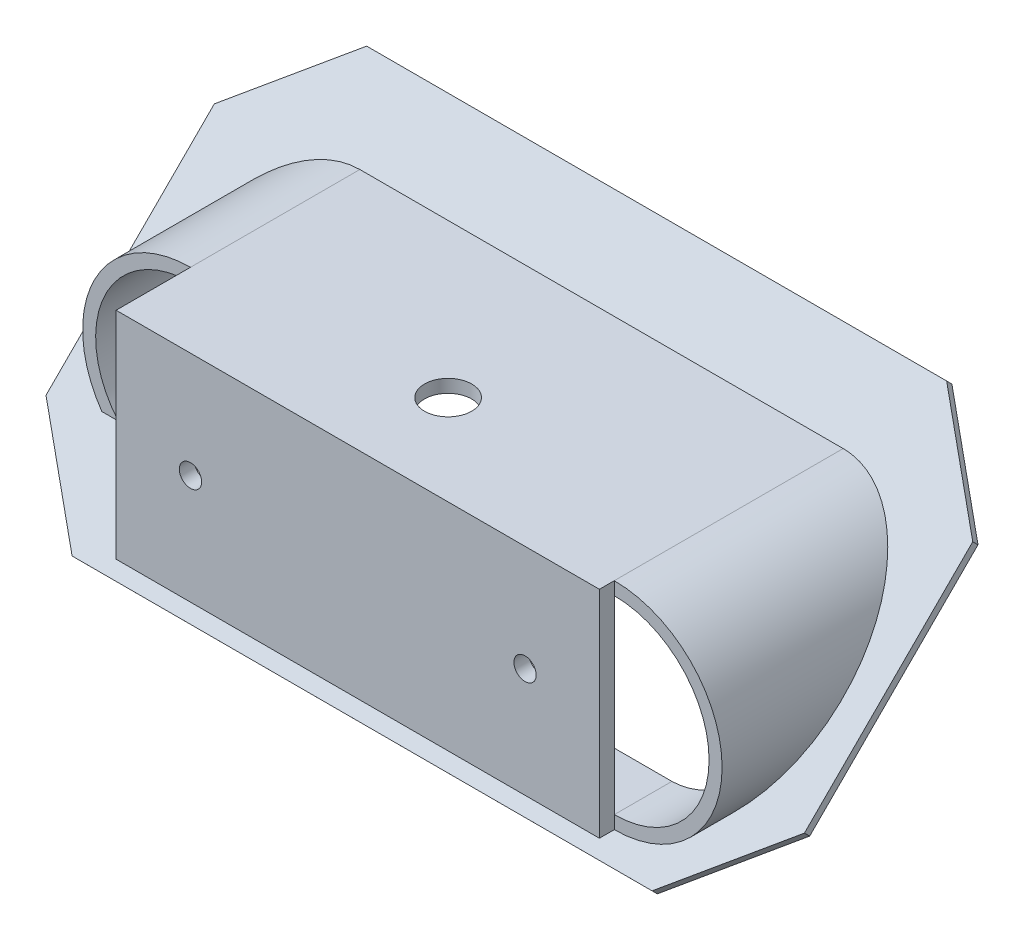
ISO-10303-21;
HEADER;
FILE_DESCRIPTION(('STEP AP214'),'2;1');
FILE_NAME('part.step','',(''),(''),'','','');
FILE_SCHEMA(('AUTOMOTIVE_DESIGN { 1 0 10303 214 1 1 1 1 }'));
ENDSEC;
DATA;
#1=APPLICATION_CONTEXT('core data for automotive mechanical design processes');
#2=APPLICATION_PROTOCOL_DEFINITION('international standard','automotive_design',2000,#1);
#3=PRODUCT_CONTEXT('',#1,'mechanical');
#4=PRODUCT('Part','Part','',(#3));
#5=PRODUCT_RELATED_PRODUCT_CATEGORY('part','',(#4));
#6=PRODUCT_DEFINITION_FORMATION('','',#4);
#7=PRODUCT_DEFINITION_CONTEXT('part definition',#1,'design');
#8=PRODUCT_DEFINITION('design','',#6,#7);
#9=PRODUCT_DEFINITION_SHAPE('','',#8);
#10=(LENGTH_UNIT() NAMED_UNIT(*) SI_UNIT(.MILLI.,.METRE.));
#11=(NAMED_UNIT(*) PLANE_ANGLE_UNIT() SI_UNIT($,.RADIAN.));
#12=(NAMED_UNIT(*) SI_UNIT($,.STERADIAN.) SOLID_ANGLE_UNIT());
#13=UNCERTAINTY_MEASURE_WITH_UNIT(LENGTH_MEASURE(1.E-05),#10,'distance_accuracy_value','');
#14=(GEOMETRIC_REPRESENTATION_CONTEXT(3) GLOBAL_UNCERTAINTY_ASSIGNED_CONTEXT((#13)) GLOBAL_UNIT_ASSIGNED_CONTEXT((#10,
#11,#12)) REPRESENTATION_CONTEXT('',''));
#15=CARTESIAN_POINT('',(0.,0.,0.));
#16=DIRECTION('',(0.,0.,1.));
#17=DIRECTION('',(1.,0.,0.));
#18=AXIS2_PLACEMENT_3D('',#15,#16,#17);
#19=CARTESIAN_POINT('',(69.7281455494334,21.9121249549721,35.0250079347562));
#20=DIRECTION('',(0.,0.,1.));
#21=DIRECTION('',(1.,0.,0.));
#22=AXIS2_PLACEMENT_3D('',#19,#20,#21);
#23=PLANE('',#22);
#24=DIRECTION('',(0.,1.,0.));
#25=VECTOR('',#24,1.);
#26=CARTESIAN_POINT('',(32.5000000000001,-14.5,35.0250079347562));
#27=LINE('',#26,#25);
#28=CARTESIAN_POINT('',(32.5000000000001,-14.5,35.0250079347562));
#29=VERTEX_POINT('',#28);
#30=CARTESIAN_POINT('',(32.5000000000001,-12.75,35.0250079347562));
#31=VERTEX_POINT('',#30);
#32=EDGE_CURVE('E51',#29,#31,#27,.T.);
#33=ORIENTED_EDGE('',*,*,#32,.F.);
#34=CARTESIAN_POINT('',(32.5000000000001,0.,35.0250079347562));
#35=DIRECTION('',(0.,0.,1.));
#36=DIRECTION('',(1.,0.,0.));
#37=AXIS2_PLACEMENT_3D('',#34,#35,#36);
#38=CIRCLE('',#37,14.5);
#39=CARTESIAN_POINT('',(32.5000000000001,14.5,35.0250079347562));
#40=VERTEX_POINT('',#39);
#41=EDGE_CURVE('E280',#29,#40,#38,.T.);
#42=ORIENTED_EDGE('',*,*,#41,.T.);
#43=CARTESIAN_POINT('',(32.5000000000001,12.75,35.0250079347562));
#44=VERTEX_POINT('',#43);
#45=EDGE_CURVE('E11',#44,#40,#27,.T.);
#46=ORIENTED_EDGE('',*,*,#45,.F.);
#47=CARTESIAN_POINT('',(32.5000000000001,0.,35.0250079347562));
#48=DIRECTION('',(0.,0.,1.));
#49=DIRECTION('',(1.,0.,0.));
#50=AXIS2_PLACEMENT_3D('',#47,#48,#49);
#51=CIRCLE('',#50,12.75);
#52=EDGE_CURVE('E274',#44,#31,#51,.F.);
#53=ORIENTED_EDGE('',*,*,#52,.T.);
#54=EDGE_LOOP('',(#33,#42,#46,#53));
#55=FACE_BOUND('',#54,.T.);
#56=ADVANCED_FACE('F40',(#55),#23,.T.);
#57=CARTESIAN_POINT('',(0.,14.5,80.0000000000001));
#58=DIRECTION('',(0.,-1.,0.));
#59=DIRECTION('',(0.,0.,-1.));
#60=AXIS2_PLACEMENT_3D('',#57,#58,#59);
#61=PLANE('',#60);
#62=CARTESIAN_POINT('',(2.62925291935353E-05,14.5,24.8750079347541));
#63=DIRECTION('',(0.,1.,0.));
#64=DIRECTION('',(0.,0.,1.));
#65=AXIS2_PLACEMENT_3D('',#62,#63,#64);
#66=CIRCLE('',#65,3.17499999999999);
#67=CARTESIAN_POINT('',(2.62925291935353E-05,14.5,28.0500079347541));
#68=VERTEX_POINT('',#67);
#69=EDGE_CURVE('E247',#68,#68,#66,.T.);
#70=ORIENTED_EDGE('',*,*,#69,.F.);
#71=EDGE_LOOP('',(#70));
#72=FACE_BOUND('',#71,.T.);
#73=DIRECTION('',(0.,0.,-1.));
#74=VECTOR('',#73,1.);
#75=CARTESIAN_POINT('',(-32.5000000000001,14.5,80.0000000000001));
#76=LINE('',#75,#74);
#77=CARTESIAN_POINT('',(-32.5000000000001,14.5,37.0250079347562));
#78=VERTEX_POINT('',#77);
#79=CARTESIAN_POINT('',(-32.5000000000001,14.5,27.0250079347562));
#80=VERTEX_POINT('',#79);
#81=EDGE_CURVE('E317',#78,#80,#76,.T.);
#82=ORIENTED_EDGE('',*,*,#81,.F.);
#83=DIRECTION('',(1.,0.,0.));
#84=VECTOR('',#83,1.);
#85=CARTESIAN_POINT('',(-32.5000000000001,14.5,37.0250079347562));
#86=LINE('',#85,#84);
#87=CARTESIAN_POINT('',(32.5000000000001,14.5,37.0250079347562));
#88=VERTEX_POINT('',#87);
#89=EDGE_CURVE('E224',#78,#88,#86,.T.);
#90=ORIENTED_EDGE('',*,*,#89,.T.);
#91=DIRECTION('',(0.,0.,-1.));
#92=VECTOR('',#91,1.);
#93=CARTESIAN_POINT('',(32.5000000000001,14.5,35.0250079347562));
#94=LINE('',#93,#92);
#95=EDGE_CURVE('E232',#88,#40,#94,.T.);
#96=ORIENTED_EDGE('',*,*,#95,.T.);
#97=DIRECTION('',(0.,0.,-1.));
#98=VECTOR('',#97,1.);
#99=CARTESIAN_POINT('',(32.5000000000001,14.5,80.0000000000001));
#100=LINE('',#99,#98);
#101=CARTESIAN_POINT('',(32.5000000000001,14.5,4.24460595078653));
#102=VERTEX_POINT('',#101);
#103=EDGE_CURVE('E314',#40,#102,#100,.T.);
#104=ORIENTED_EDGE('',*,*,#103,.T.);
#105=DIRECTION('',(-1.,0.,0.));
#106=VECTOR('',#105,1.);
#107=CARTESIAN_POINT('',(0.,14.5,4.24460595078653));
#108=LINE('',#107,#106);
#109=CARTESIAN_POINT('',(-32.5000000000001,14.5,4.24460595078652));
#110=VERTEX_POINT('',#109);
#111=EDGE_CURVE('E311',#102,#110,#108,.T.);
#112=ORIENTED_EDGE('',*,*,#111,.T.);
#113=EDGE_CURVE('E215',#80,#110,#76,.T.);
#114=ORIENTED_EDGE('',*,*,#113,.F.);
#115=EDGE_LOOP('',(#82,#90,#96,#104,#112,#114));
#116=FACE_BOUND('',#115,.T.);
#117=ADVANCED_FACE('F472',(#72,#116),#61,.F.);
#118=CARTESIAN_POINT('',(-32.5000000000001,0.,80.0000000000001));
#119=DIRECTION('',(0.,0.,-1.));
#120=DIRECTION('',(-1.,0.,0.));
#121=AXIS2_PLACEMENT_3D('',#118,#119,#120);
#122=CYLINDRICAL_SURFACE('',#121,14.5);
#123=CARTESIAN_POINT('',(-32.5000000000001,0.,18.7580361379704));
#124=DIRECTION('',(0.,0.707434021964028,0.706779388895714));
#125=DIRECTION('',(0.,0.706779388895714,-0.707434021964028));
#126=AXIS2_PLACEMENT_3D('',#123,#124,#125);
#127=ELLIPSE('',#126,20.5155954288015,14.5);
#128=CARTESIAN_POINT('',(-44.4177851377498,-8.25932184930662,27.0250079347562));
#129=VERTEX_POINT('',#128);
#130=EDGE_CURVE('E308',#110,#129,#127,.T.);
#131=ORIENTED_EDGE('',*,*,#130,.T.);
#132=CARTESIAN_POINT('',(-32.5000000000001,0.,27.0250079347562));
#133=DIRECTION('',(0.,0.,-1.));
#134=DIRECTION('',(-1.,0.,0.));
#135=AXIS2_PLACEMENT_3D('',#132,#133,#134);
#136=CIRCLE('',#135,14.5);
#137=EDGE_CURVE('E268',#129,#80,#136,.T.);
#138=ORIENTED_EDGE('',*,*,#137,.T.);
#139=ORIENTED_EDGE('',*,*,#113,.T.);
#140=EDGE_LOOP('',(#131,#138,#139));
#141=FACE_BOUND('',#140,.T.);
#142=ADVANCED_FACE('F478',(#141),#122,.T.);
#143=CARTESIAN_POINT('',(0.,-14.5,80.0000000000001));
#144=DIRECTION('',(0.,-1.,0.));
#145=DIRECTION('',(0.,0.,-1.));
#146=AXIS2_PLACEMENT_3D('',#143,#144,#145);
#147=PLANE('',#146);
#148=DIRECTION('',(0.,0.,-1.));
#149=VECTOR('',#148,1.);
#150=CARTESIAN_POINT('',(32.5000000000001,-14.5,80.0000000000001));
#151=LINE('',#150,#149);
#152=CARTESIAN_POINT('',(32.5000000000001,-14.5,33.2714663251543));
#153=VERTEX_POINT('',#152);
#154=EDGE_CURVE('E216',#29,#153,#151,.T.);
#155=ORIENTED_EDGE('',*,*,#154,.F.);
#156=DIRECTION('',(0.,0.,-1.));
#157=VECTOR('',#156,1.);
#158=CARTESIAN_POINT('',(32.5000000000001,-14.5,35.0250079347562));
#159=LINE('',#158,#157);
#160=CARTESIAN_POINT('',(32.5000000000001,-14.5,37.0250079347562));
#161=VERTEX_POINT('',#160);
#162=EDGE_CURVE('E231',#161,#29,#159,.T.);
#163=ORIENTED_EDGE('',*,*,#162,.F.);
#164=DIRECTION('',(1.,0.,0.));
#165=VECTOR('',#164,1.);
#166=CARTESIAN_POINT('',(-32.5000000000001,-14.5,37.0250079347562));
#167=LINE('',#166,#165);
#168=CARTESIAN_POINT('',(-32.5000000000001,-14.5,37.0250079347562));
#169=VERTEX_POINT('',#168);
#170=EDGE_CURVE('E221',#169,#161,#167,.T.);
#171=ORIENTED_EDGE('',*,*,#170,.F.);
#172=DIRECTION('',(0.,0.,-1.));
#173=VECTOR('',#172,1.);
#174=CARTESIAN_POINT('',(-32.5000000000001,-14.5,80.0000000000001));
#175=LINE('',#174,#173);
#176=CARTESIAN_POINT('',(-32.5000000000001,-14.5,33.2714663251542));
#177=VERTEX_POINT('',#176);
#178=EDGE_CURVE('E203',#169,#177,#175,.T.);
#179=ORIENTED_EDGE('',*,*,#178,.T.);
#180=DIRECTION('',(-1.,0.,0.));
#181=VECTOR('',#180,1.);
#182=CARTESIAN_POINT('',(0.,-14.5,33.2714663251543));
#183=LINE('',#182,#181);
#184=EDGE_CURVE('E306',#153,#177,#183,.T.);
#185=ORIENTED_EDGE('',*,*,#184,.F.);
#186=EDGE_LOOP('',(#155,#163,#171,#179,#185));
#187=FACE_BOUND('',#186,.T.);
#188=ADVANCED_FACE('F229',(#187),#147,.T.);
#189=CARTESIAN_POINT('',(32.5000000000001,0.,80.0000000000001));
#190=DIRECTION('',(0.,0.,-1.));
#191=DIRECTION('',(-1.,0.,0.));
#192=AXIS2_PLACEMENT_3D('',#189,#190,#191);
#193=CYLINDRICAL_SURFACE('',#192,14.5);
#194=ORIENTED_EDGE('',*,*,#41,.F.);
#195=ORIENTED_EDGE('',*,*,#154,.T.);
#196=CARTESIAN_POINT('',(32.5000000000001,0.,18.7580361379704));
#197=DIRECTION('',(0.,0.707434021964028,0.706779388895714));
#198=DIRECTION('',(0.,0.706779388895714,-0.707434021964028));
#199=AXIS2_PLACEMENT_3D('',#196,#197,#198);
#200=ELLIPSE('',#199,20.5155954288015,14.5);
#201=EDGE_CURVE('E319',#153,#102,#200,.T.);
#202=ORIENTED_EDGE('',*,*,#201,.T.);
#203=ORIENTED_EDGE('',*,*,#103,.F.);
#204=EDGE_LOOP('',(#194,#195,#202,#203));
#205=FACE_BOUND('',#204,.T.);
#206=ADVANCED_FACE('F500',(#205),#193,.T.);
#207=CARTESIAN_POINT('',(-32.5000000000001,0.,-5.29472242780894));
#208=DIRECTION('',(0.,0.,1.));
#209=DIRECTION('',(1.,0.,0.));
#210=AXIS2_PLACEMENT_3D('',#207,#208,#209);
#211=CYLINDRICAL_SURFACE('',#210,12.75);
#212=CARTESIAN_POINT('',(-32.5000000000001,0.,27.0250079347562));
#213=DIRECTION('',(0.,0.,-1.));
#214=DIRECTION('',(-1.,0.,0.));
#215=AXIS2_PLACEMENT_3D('',#212,#213,#214);
#216=CIRCLE('',#215,12.75);
#217=CARTESIAN_POINT('',(-32.5000000000001,12.75,27.0250079347562));
#218=VERTEX_POINT('',#217);
#219=CARTESIAN_POINT('',(-42.2131921935875,-8.25932184930662,27.0250079347562));
#220=VERTEX_POINT('',#219);
#221=EDGE_CURVE('E265',#218,#220,#216,.F.);
#222=ORIENTED_EDGE('',*,*,#221,.T.);
#223=CARTESIAN_POINT('',(-32.5000000000001,0.,18.7580361379704));
#224=DIRECTION('',(0.,-0.707434021964029,-0.706779388895714));
#225=DIRECTION('',(0.,-0.706779388895714,0.707434021964029));
#226=AXIS2_PLACEMENT_3D('',#223,#224,#225);
#227=ELLIPSE('',#226,18.0395752908427,12.75);
#228=CARTESIAN_POINT('',(-32.5000000000001,-12.75,31.5198454404941));
#229=VERTEX_POINT('',#228);
#230=EDGE_CURVE('E271',#220,#229,#227,.F.);
#231=ORIENTED_EDGE('',*,*,#230,.T.);
#232=DIRECTION('',(0.,0.,1.));
#233=VECTOR('',#232,1.);
#234=CARTESIAN_POINT('',(-32.5000000000001,-12.75,-5.29472242780894));
#235=LINE('',#234,#233);
#236=CARTESIAN_POINT('',(-32.5000000000001,-12.75,27.2752394897076));
#237=VERTEX_POINT('',#236);
#238=EDGE_CURVE('E283',#237,#229,#235,.T.);
#239=ORIENTED_EDGE('',*,*,#238,.F.);
#240=CARTESIAN_POINT('',(-32.5000000000001,0.,14.5134301871838));
#241=DIRECTION('',(0.,0.707434021964029,0.706779388895714));
#242=DIRECTION('',(0.,-0.706779388895714,0.707434021964029));
#243=AXIS2_PLACEMENT_3D('',#240,#241,#242);
#244=ELLIPSE('',#243,18.0395752908427,12.75);
#245=CARTESIAN_POINT('',(-32.5000000000001,12.75,1.75162088466012));
#246=VERTEX_POINT('',#245);
#247=EDGE_CURVE('E330',#246,#237,#244,.T.);
#248=ORIENTED_EDGE('',*,*,#247,.F.);
#249=DIRECTION('',(0.,0.,1.));
#250=VECTOR('',#249,1.);
#251=CARTESIAN_POINT('',(-32.5000000000001,12.75,-5.29472242780894));
#252=LINE('',#251,#250);
#253=EDGE_CURVE('E284',#246,#218,#252,.T.);
#254=ORIENTED_EDGE('',*,*,#253,.T.);
#255=EDGE_LOOP('',(#222,#231,#239,#248,#254));
#256=FACE_BOUND('',#255,.T.);
#257=ADVANCED_FACE('F489',(#256),#211,.F.);
#258=CARTESIAN_POINT('',(-32.5000000000001,12.75,-5.29472242780894));
#259=DIRECTION('',(0.,-1.,0.));
#260=DIRECTION('',(1.,0.,0.));
#261=AXIS2_PLACEMENT_3D('',#258,#259,#260);
#262=PLANE('',#261);
#263=CARTESIAN_POINT('',(2.62925291935353E-05,12.75,24.8750079347541));
#264=DIRECTION('',(0.,-1.,0.));
#265=DIRECTION('',(1.,0.,0.));
#266=AXIS2_PLACEMENT_3D('',#263,#264,#265);
#267=CIRCLE('',#266,3.17499999999999);
#268=CARTESIAN_POINT('',(3.17502629252919,12.75,24.8750079347541));
#269=VERTEX_POINT('',#268);
#270=EDGE_CURVE('E250',#269,#269,#267,.T.);
#271=ORIENTED_EDGE('',*,*,#270,.F.);
#272=EDGE_LOOP('',(#271));
#273=FACE_BOUND('',#272,.T.);
#274=DIRECTION('',(0.,0.,1.));
#275=VECTOR('',#274,1.);
#276=CARTESIAN_POINT('',(32.5000000000001,12.75,-5.29472242780894));
#277=LINE('',#276,#275);
#278=CARTESIAN_POINT('',(32.5000000000001,12.75,1.75162088466014));
#279=VERTEX_POINT('',#278);
#280=EDGE_CURVE('E288',#279,#44,#277,.T.);
#281=ORIENTED_EDGE('',*,*,#280,.T.);
#282=DIRECTION('',(-1.,0.,0.));
#283=VECTOR('',#282,1.);
#284=CARTESIAN_POINT('',(-32.5000000000001,12.75,35.0250079347562));
#285=LINE('',#284,#283);
#286=CARTESIAN_POINT('',(-32.5000000000001,12.75,35.0250079347562));
#287=VERTEX_POINT('',#286);
#288=EDGE_CURVE('E277',#44,#287,#285,.T.);
#289=ORIENTED_EDGE('',*,*,#288,.T.);
#290=DIRECTION('',(0.,0.,-1.));
#291=VECTOR('',#290,1.);
#292=CARTESIAN_POINT('',(-32.5000000000001,12.75,-5.29472242780894));
#293=LINE('',#292,#291);
#294=EDGE_CURVE('E262',#287,#218,#293,.T.);
#295=ORIENTED_EDGE('',*,*,#294,.T.);
#296=ORIENTED_EDGE('',*,*,#253,.F.);
#297=DIRECTION('',(1.,0.,0.));
#298=VECTOR('',#297,1.);
#299=CARTESIAN_POINT('',(-47.0000000000001,12.75,1.75162088466011));
#300=LINE('',#299,#298);
#301=EDGE_CURVE('E328',#246,#279,#300,.T.);
#302=ORIENTED_EDGE('',*,*,#301,.T.);
#303=EDGE_LOOP('',(#281,#289,#295,#296,#302));
#304=FACE_BOUND('',#303,.T.);
#305=ADVANCED_FACE('F485',(#273,#304),#262,.T.);
#306=CARTESIAN_POINT('',(32.5000000000001,0.,-5.29472242780894));
#307=DIRECTION('',(0.,0.,1.));
#308=DIRECTION('',(1.,0.,0.));
#309=AXIS2_PLACEMENT_3D('',#306,#307,#308);
#310=CYLINDRICAL_SURFACE('',#309,12.75);
#311=ORIENTED_EDGE('',*,*,#52,.F.);
#312=ORIENTED_EDGE('',*,*,#280,.F.);
#313=CARTESIAN_POINT('',(32.5000000000001,0.,14.5134301871839));
#314=DIRECTION('',(0.,0.707434021964029,0.706779388895714));
#315=DIRECTION('',(0.,-0.706779388895714,0.707434021964029));
#316=AXIS2_PLACEMENT_3D('',#313,#314,#315);
#317=ELLIPSE('',#316,18.0395752908427,12.75);
#318=CARTESIAN_POINT('',(32.5000000000001,-12.75,27.2752394897076));
#319=VERTEX_POINT('',#318);
#320=EDGE_CURVE('E325',#319,#279,#317,.T.);
#321=ORIENTED_EDGE('',*,*,#320,.F.);
#322=DIRECTION('',(0.,0.,1.));
#323=VECTOR('',#322,1.);
#324=CARTESIAN_POINT('',(32.5000000000001,-12.75,-5.29472242780894));
#325=LINE('',#324,#323);
#326=EDGE_CURVE('E291',#319,#31,#325,.T.);
#327=ORIENTED_EDGE('',*,*,#326,.T.);
#328=EDGE_LOOP('',(#311,#312,#321,#327));
#329=FACE_BOUND('',#328,.T.);
#330=ADVANCED_FACE('F488',(#329),#310,.F.);
#331=CARTESIAN_POINT('',(-32.5000000000001,-12.75,-5.29472242780894));
#332=DIRECTION('',(0.,-1.,0.));
#333=DIRECTION('',(1.,0.,0.));
#334=AXIS2_PLACEMENT_3D('',#331,#332,#333);
#335=PLANE('',#334);
#336=DIRECTION('',(-1.,0.,0.));
#337=VECTOR('',#336,1.);
#338=CARTESIAN_POINT('',(-32.5000000000001,-12.75,35.0250079347562));
#339=LINE('',#338,#337);
#340=CARTESIAN_POINT('',(-32.5000000000001,-12.75,35.0250079347562));
#341=VERTEX_POINT('',#340);
#342=EDGE_CURVE('E333',#31,#341,#339,.T.);
#343=ORIENTED_EDGE('',*,*,#342,.F.);
#344=ORIENTED_EDGE('',*,*,#326,.F.);
#345=DIRECTION('',(1.,0.,0.));
#346=VECTOR('',#345,1.);
#347=CARTESIAN_POINT('',(-47.0000000000001,-12.75,27.2752394897076));
#348=LINE('',#347,#346);
#349=EDGE_CURVE('E322',#237,#319,#348,.T.);
#350=ORIENTED_EDGE('',*,*,#349,.F.);
#351=ORIENTED_EDGE('',*,*,#238,.T.);
#352=DIRECTION('',(0.,0.,-1.));
#353=VECTOR('',#352,1.);
#354=CARTESIAN_POINT('',(-32.5000000000001,-12.75,-5.29472242780894));
#355=LINE('',#354,#353);
#356=EDGE_CURVE('E260',#341,#229,#355,.T.);
#357=ORIENTED_EDGE('',*,*,#356,.F.);
#358=EDGE_LOOP('',(#343,#344,#350,#351,#357));
#359=FACE_BOUND('',#358,.T.);
#360=ADVANCED_FACE('F493',(#359),#335,.F.);
#361=CARTESIAN_POINT('',(51.,21.9121249549721,-3.17438426112178));
#362=DIRECTION('',(1.,0.,0.));
#363=DIRECTION('',(0.,0.,-1.));
#364=AXIS2_PLACEMENT_3D('',#361,#362,#363);
#365=PLANE('',#364);
#366=DIRECTION('',(0.,-0.707434021964028,-0.706779388895714));
#367=VECTOR('',#366,1.);
#368=CARTESIAN_POINT('',(51.,-9.18616815643932,27.9527127052955));
#369=LINE('',#368,#367);
#370=CARTESIAN_POINT('',(51.,-9.18616815643931,27.9527127052955));
#371=VERTEX_POINT('',#370);
#372=CARTESIAN_POINT('',(51.,-9.89360217840334,27.2459333163998));
#373=VERTEX_POINT('',#372);
#374=EDGE_CURVE('E353',#371,#373,#369,.T.);
#375=ORIENTED_EDGE('',*,*,#374,.T.);
#376=DIRECTION('',(0.,0.706779388895714,-0.707434021964029));
#377=VECTOR('',#376,1.);
#378=CARTESIAN_POINT('',(51.,12.7233382662595,4.60804461355087));
#379=LINE('',#378,#377);
#380=CARTESIAN_POINT('',(51.,12.7233382662595,4.60804461355086));
#381=VERTEX_POINT('',#380);
#382=EDGE_CURVE('E383',#373,#381,#379,.T.);
#383=ORIENTED_EDGE('',*,*,#382,.T.);
#384=DIRECTION('',(0.,0.707434021964028,0.706779388895714));
#385=VECTOR('',#384,1.);
#386=CARTESIAN_POINT('',(51.,13.4307722882235,5.31482400244658));
#387=LINE('',#386,#385);
#388=CARTESIAN_POINT('',(51.,13.4307722882235,5.31482400244658));
#389=VERTEX_POINT('',#388);
#390=EDGE_CURVE('E356',#381,#389,#387,.T.);
#391=ORIENTED_EDGE('',*,*,#390,.T.);
#392=DIRECTION('',(0.,-0.706779388895714,0.707434021964028));
#393=VECTOR('',#392,1.);
#394=CARTESIAN_POINT('',(51.,21.9121249549721,-3.17438426112178));
#395=LINE('',#394,#393);
#396=EDGE_CURVE('E287',#389,#371,#395,.T.);
#397=ORIENTED_EDGE('',*,*,#396,.T.);
#398=EDGE_LOOP('',(#375,#383,#391,#397));
#399=FACE_BOUND('',#398,.T.);
#400=ADVANCED_FACE('F450',(#399),#365,.T.);
#401=CARTESIAN_POINT('',(-51.,21.9121249549721,-3.1743842611218));
#402=DIRECTION('',(0.,0.706779388895714,-0.707434021964028));
#403=DIRECTION('',(0.,0.707434021964028,0.706779388895714));
#404=AXIS2_PLACEMENT_3D('',#401,#402,#403);
#405=PLANE('',#404);
#406=DIRECTION('',(0.,-0.707434021964028,-0.706779388895714));
#407=VECTOR('',#406,1.);
#408=CARTESIAN_POINT('',(39.,21.9121249549721,-3.17438426112178));
#409=LINE('',#408,#407);
#410=CARTESIAN_POINT('',(39.,21.9121249549721,-3.17438426112178));
#411=VERTEX_POINT('',#410);
#412=CARTESIAN_POINT('',(39.,21.2046909330081,-3.88116365001749));
#413=VERTEX_POINT('',#412);
#414=EDGE_CURVE('E340',#411,#413,#409,.T.);
#415=ORIENTED_EDGE('',*,*,#414,.T.);
#416=DIRECTION('',(-1.,0.,0.));
#417=VECTOR('',#416,1.);
#418=CARTESIAN_POINT('',(-39.,21.2046909330081,-3.88116365001751));
#419=LINE('',#418,#417);
#420=CARTESIAN_POINT('',(-39.,21.2046909330081,-3.88116365001751));
#421=VERTEX_POINT('',#420);
#422=EDGE_CURVE('E387',#413,#421,#419,.T.);
#423=ORIENTED_EDGE('',*,*,#422,.T.);
#424=DIRECTION('',(0.,0.707434021964028,0.706779388895714));
#425=VECTOR('',#424,1.);
#426=CARTESIAN_POINT('',(-39.,21.9121249549721,-3.1743842611218));
#427=LINE('',#426,#425);
#428=CARTESIAN_POINT('',(-39.,21.9121249549721,-3.1743842611218));
#429=VERTEX_POINT('',#428);
#430=EDGE_CURVE('E343',#421,#429,#427,.T.);
#431=ORIENTED_EDGE('',*,*,#430,.T.);
#432=DIRECTION('',(1.,0.,0.));
#433=VECTOR('',#432,1.);
#434=CARTESIAN_POINT('',(-51.,21.9121249549721,-3.1743842611218));
#435=LINE('',#434,#433);
#436=EDGE_CURVE('E303',#429,#411,#435,.T.);
#437=ORIENTED_EDGE('',*,*,#436,.T.);
#438=EDGE_LOOP('',(#415,#423,#431,#437));
#439=FACE_BOUND('',#438,.T.);
#440=ADVANCED_FACE('F459',(#439),#405,.T.);
#441=CARTESIAN_POINT('',(-51.,21.9121249549721,-3.1743842611218));
#442=DIRECTION('',(-1.,0.,0.));
#443=DIRECTION('',(0.,-1.,0.));
#444=AXIS2_PLACEMENT_3D('',#441,#442,#443);
#445=PLANE('',#444);
#446=DIRECTION('',(0.,-0.707434021964028,-0.706779388895714));
#447=VECTOR('',#446,1.);
#448=CARTESIAN_POINT('',(-51.,13.4307722882235,5.31482400244653));
#449=LINE('',#448,#447);
#450=CARTESIAN_POINT('',(-51.,13.4307722882235,5.31482400244653));
#451=VERTEX_POINT('',#450);
#452=CARTESIAN_POINT('',(-51.,12.7233382662595,4.60804461355082));
#453=VERTEX_POINT('',#452);
#454=EDGE_CURVE('E338',#451,#453,#449,.T.);
#455=ORIENTED_EDGE('',*,*,#454,.T.);
#456=DIRECTION('',(0.,-0.706779388895714,0.707434021964029));
#457=VECTOR('',#456,1.);
#458=CARTESIAN_POINT('',(-51.,-9.89360217840331,27.2459333163997));
#459=LINE('',#458,#457);
#460=CARTESIAN_POINT('',(-51.,-9.89360217840331,27.2459333163997));
#461=VERTEX_POINT('',#460);
#462=EDGE_CURVE('E65',#453,#461,#459,.T.);
#463=ORIENTED_EDGE('',*,*,#462,.T.);
#464=DIRECTION('',(0.,0.707434021964028,0.706779388895714));
#465=VECTOR('',#464,1.);
#466=CARTESIAN_POINT('',(-51.,-9.18616815643929,27.9527127052954));
#467=LINE('',#466,#465);
#468=CARTESIAN_POINT('',(-51.,-9.18616815643929,27.9527127052954));
#469=VERTEX_POINT('',#468);
#470=EDGE_CURVE('E336',#461,#469,#467,.T.);
#471=ORIENTED_EDGE('',*,*,#470,.T.);
#472=DIRECTION('',(0.,0.706779388895714,-0.707434021964028));
#473=VECTOR('',#472,1.);
#474=CARTESIAN_POINT('',(-51.,21.9121249549721,-3.1743842611218));
#475=LINE('',#474,#473);
#476=EDGE_CURVE('E300',#469,#451,#475,.T.);
#477=ORIENTED_EDGE('',*,*,#476,.T.);
#478=EDGE_LOOP('',(#455,#463,#471,#477));
#479=FACE_BOUND('',#478,.T.);
#480=ADVANCED_FACE('F462',(#479),#445,.T.);
#481=CARTESIAN_POINT('',(-51.,-17.6675208231879,36.4419209688638));
#482=DIRECTION('',(0.,-0.706779388895714,0.707434021964028));
#483=DIRECTION('',(0.,-0.707434021964028,-0.706779388895714));
#484=AXIS2_PLACEMENT_3D('',#481,#482,#483);
#485=PLANE('',#484);
#486=DIRECTION('',(0.,-0.707434021964028,-0.706779388895714));
#487=VECTOR('',#486,1.);
#488=CARTESIAN_POINT('',(-39.,-17.6675208231879,36.4419209688638));
#489=LINE('',#488,#487);
#490=CARTESIAN_POINT('',(-39.,-17.6675208231879,36.4419209688638));
#491=VERTEX_POINT('',#490);
#492=CARTESIAN_POINT('',(-39.,-18.3749548451519,35.7351415799681));
#493=VERTEX_POINT('',#492);
#494=EDGE_CURVE('E358',#491,#493,#489,.T.);
#495=ORIENTED_EDGE('',*,*,#494,.T.);
#496=DIRECTION('',(1.,0.,0.));
#497=VECTOR('',#496,1.);
#498=CARTESIAN_POINT('',(38.9999999999999,-18.3749548451519,35.7351415799681));
#499=LINE('',#498,#497);
#500=CARTESIAN_POINT('',(38.9999999999999,-18.3749548451519,35.7351415799681));
#501=VERTEX_POINT('',#500);
#502=EDGE_CURVE('E389',#493,#501,#499,.T.);
#503=ORIENTED_EDGE('',*,*,#502,.T.);
#504=DIRECTION('',(0.,0.707434021964028,0.706779388895714));
#505=VECTOR('',#504,1.);
#506=CARTESIAN_POINT('',(38.9999999999999,-17.6675208231879,36.4419209688638));
#507=LINE('',#506,#505);
#508=CARTESIAN_POINT('',(38.9999999999999,-17.6675208231879,36.4419209688638));
#509=VERTEX_POINT('',#508);
#510=EDGE_CURVE('E361',#501,#509,#507,.T.);
#511=ORIENTED_EDGE('',*,*,#510,.T.);
#512=DIRECTION('',(-1.,0.,0.));
#513=VECTOR('',#512,1.);
#514=CARTESIAN_POINT('',(-51.,-17.6675208231879,36.4419209688638));
#515=LINE('',#514,#513);
#516=EDGE_CURVE('E297',#509,#491,#515,.T.);
#517=ORIENTED_EDGE('',*,*,#516,.T.);
#518=EDGE_LOOP('',(#495,#503,#511,#517));
#519=FACE_BOUND('',#518,.T.);
#520=ADVANCED_FACE('F436',(#519),#485,.T.);
#521=CARTESIAN_POINT('',(0.,9.37901404965901,9.37033505973985));
#522=DIRECTION('',(0.,0.707434021964028,0.706779388895714));
#523=DIRECTION('',(0.,-0.706779388895714,0.707434021964028));
#524=AXIS2_PLACEMENT_3D('',#521,#522,#523);
#525=PLANE('',#524);
#526=ORIENTED_EDGE('',*,*,#184,.T.);
#527=DIRECTION('',(0.,-0.706779388895714,0.707434021964028));
#528=VECTOR('',#527,1.);
#529=CARTESIAN_POINT('',(-32.5000000000001,-8.25932184930661,27.0250079347562));
#530=LINE('',#529,#528);
#531=EDGE_CURVE('E210',#229,#177,#530,.T.);
#532=ORIENTED_EDGE('',*,*,#531,.F.);
#533=ORIENTED_EDGE('',*,*,#230,.F.);
#534=DIRECTION('',(-1.,0.,0.));
#535=VECTOR('',#534,1.);
#536=CARTESIAN_POINT('',(-32.5000000000001,-8.25932184930661,27.0250079347562));
#537=LINE('',#536,#535);
#538=EDGE_CURVE('E257',#220,#129,#537,.T.);
#539=ORIENTED_EDGE('',*,*,#538,.T.);
#540=ORIENTED_EDGE('',*,*,#130,.F.);
#541=ORIENTED_EDGE('',*,*,#111,.F.);
#542=ORIENTED_EDGE('',*,*,#201,.F.);
#543=EDGE_LOOP('',(#526,#532,#533,#539,#540,#541,#542));
#544=FACE_BOUND('',#543,.T.);
#545=ORIENTED_EDGE('',*,*,#436,.F.);
#546=DIRECTION('',(0.707106781186549,0.499768498691042,-0.500231394172836));
#547=VECTOR('',#546,1.);
#548=CARTESIAN_POINT('',(-28.3663528550931,29.427767585782,-10.6969880289895));
#549=LINE('',#548,#547);
#550=EDGE_CURVE('E351',#429,#451,#549,.F.);
#551=ORIENTED_EDGE('',*,*,#550,.T.);
#552=ORIENTED_EDGE('',*,*,#476,.F.);
#553=DIRECTION('',(-0.707106781186546,0.499768498691044,-0.500231394172839));
#554=VECTOR('',#553,1.);
#555=CARTESIAN_POINT('',(-38.6336471449069,-17.9264514702308,36.7010914426003));
#556=LINE('',#555,#554);
#557=EDGE_CURVE('E345',#469,#491,#556,.F.);
#558=ORIENTED_EDGE('',*,*,#557,.T.);
#559=ORIENTED_EDGE('',*,*,#516,.F.);
#560=DIRECTION('',(-0.707106781186549,-0.499768498691042,0.500231394172836));
#561=VECTOR('',#560,1.);
#562=CARTESIAN_POINT('',(38.6336471449067,-17.9264514702309,36.7010914426004));
#563=LINE('',#562,#561);
#564=EDGE_CURVE('E347',#509,#371,#563,.F.);
#565=ORIENTED_EDGE('',*,*,#564,.T.);
#566=ORIENTED_EDGE('',*,*,#396,.F.);
#567=DIRECTION('',(0.707106781186546,-0.499768498691044,0.500231394172839));
#568=VECTOR('',#567,1.);
#569=CARTESIAN_POINT('',(28.3663528550933,29.4277675857819,-10.6969880289895));
#570=LINE('',#569,#568);
#571=EDGE_CURVE('E349',#389,#411,#570,.F.);
#572=ORIENTED_EDGE('',*,*,#571,.T.);
#573=EDGE_LOOP('',(#545,#551,#552,#558,#559,#565,#566,#572));
#574=FACE_BOUND('',#573,.T.);
#575=ADVANCED_FACE('F442',(#544,#574),#525,.T.);
#576=CARTESIAN_POINT('',(-47.0000000000001,14.5,0.));
#577=DIRECTION('',(0.,0.707434021964029,0.706779388895714));
#578=DIRECTION('',(0.,-0.706779388895714,0.707434021964029));
#579=AXIS2_PLACEMENT_3D('',#576,#577,#578);
#580=PLANE('',#579);
#581=DIRECTION('',(0.,-0.706779388895714,0.707434021964029));
#582=VECTOR('',#581,1.);
#583=CARTESIAN_POINT('',(49.,-11.3084702223314,25.8323745386083));
#584=LINE('',#583,#582);
#585=CARTESIAN_POINT('',(49.,10.7229550053587,3.78054336852269));
#586=VERTEX_POINT('',#585);
#587=CARTESIAN_POINT('',(49.,-10.7229550053587,25.246317005845));
#588=VERTEX_POINT('',#587);
#589=EDGE_CURVE('E375',#586,#588,#584,.T.);
#590=ORIENTED_EDGE('',*,*,#589,.T.);
#591=DIRECTION('',(-0.707106781186549,-0.499768498691042,0.500231394172836));
#592=VECTOR('',#591,1.);
#593=CARTESIAN_POINT('',(37.5857864376268,-18.7902858916979,33.321120013831));
#594=LINE('',#593,#592);
#595=CARTESIAN_POINT('',(38.1715728752537,-18.3762641112886,32.9067147582486));
#596=VERTEX_POINT('',#595);
#597=EDGE_CURVE('E377',#588,#596,#594,.T.);
#598=ORIENTED_EDGE('',*,*,#597,.T.);
#599=DIRECTION('',(-1.,0.,0.));
#600=VECTOR('',#599,1.);
#601=CARTESIAN_POINT('',(-39.,-18.3762641112886,32.9067147582486));
#602=LINE('',#601,#600);
#603=CARTESIAN_POINT('',(-38.1715728752538,-18.3762641112886,32.9067147582486));
#604=VERTEX_POINT('',#603);
#605=EDGE_CURVE('E369',#596,#604,#602,.T.);
#606=ORIENTED_EDGE('',*,*,#605,.T.);
#607=DIRECTION('',(-0.707106781186546,0.499768498691044,-0.500231394172839));
#608=VECTOR('',#607,1.);
#609=CARTESIAN_POINT('',(-49.5857864376269,-10.3089332249493,24.8319117502626));
#610=LINE('',#609,#608);
#611=CARTESIAN_POINT('',(-49.,-10.7229550053586,25.246317005845));
#612=VERTEX_POINT('',#611);
#613=EDGE_CURVE('E367',#604,#612,#610,.T.);
#614=ORIENTED_EDGE('',*,*,#613,.T.);
#615=DIRECTION('',(0.,0.706779388895714,-0.707434021964029));
#616=VECTOR('',#615,1.);
#617=CARTESIAN_POINT('',(-49.,11.3084702223314,3.19448583575938));
#618=LINE('',#617,#616);
#619=CARTESIAN_POINT('',(-49.,10.7229550053587,3.78054336852267));
#620=VERTEX_POINT('',#619);
#621=EDGE_CURVE('E365',#612,#620,#618,.T.);
#622=ORIENTED_EDGE('',*,*,#621,.T.);
#623=DIRECTION('',(0.707106781186549,0.499768498691042,-0.500231394172836));
#624=VECTOR('',#623,1.);
#625=CARTESIAN_POINT('',(-37.5857864376269,18.7902858916979,-4.29425963946327));
#626=LINE('',#625,#624);
#627=CARTESIAN_POINT('',(-38.1715728752538,18.3762641112886,-3.87985438388089));
#628=VERTEX_POINT('',#627);
#629=EDGE_CURVE('E363',#620,#628,#626,.T.);
#630=ORIENTED_EDGE('',*,*,#629,.T.);
#631=DIRECTION('',(1.,0.,0.));
#632=VECTOR('',#631,1.);
#633=CARTESIAN_POINT('',(39.,18.3762641112886,-3.87985438388087));
#634=LINE('',#633,#632);
#635=CARTESIAN_POINT('',(38.1715728752539,18.3762641112886,-3.87985438388087));
#636=VERTEX_POINT('',#635);
#637=EDGE_CURVE('E371',#628,#636,#634,.T.);
#638=ORIENTED_EDGE('',*,*,#637,.T.);
#639=DIRECTION('',(0.707106781186546,-0.499768498691044,0.500231394172839));
#640=VECTOR('',#639,1.);
#641=CARTESIAN_POINT('',(49.5857864376269,10.3089332249493,4.19494862410509));
#642=LINE('',#641,#640);
#643=EDGE_CURVE('E373',#636,#586,#642,.T.);
#644=ORIENTED_EDGE('',*,*,#643,.T.);
#645=EDGE_LOOP('',(#590,#598,#606,#614,#622,#630,#638,#644));
#646=FACE_BOUND('',#645,.T.);
#647=ORIENTED_EDGE('',*,*,#301,.F.);
#648=ORIENTED_EDGE('',*,*,#247,.T.);
#649=ORIENTED_EDGE('',*,*,#349,.T.);
#650=ORIENTED_EDGE('',*,*,#320,.T.);
#651=EDGE_LOOP('',(#647,#648,#649,#650));
#652=FACE_BOUND('',#651,.T.);
#653=ADVANCED_FACE('F503',(#646,#652),#580,.F.);
#654=CARTESIAN_POINT('',(-32.5000000000001,14.5,27.0250079347562));
#655=DIRECTION('',(0.,0.,-1.));
#656=DIRECTION('',(-1.,0.,0.));
#657=AXIS2_PLACEMENT_3D('',#654,#655,#656);
#658=PLANE('',#657);
#659=ORIENTED_EDGE('',*,*,#538,.F.);
#660=ORIENTED_EDGE('',*,*,#221,.F.);
#661=DIRECTION('',(0.,-1.,0.));
#662=VECTOR('',#661,1.);
#663=CARTESIAN_POINT('',(-32.5000000000001,14.5,27.0250079347562));
#664=LINE('',#663,#662);
#665=EDGE_CURVE('E253',#80,#218,#664,.T.);
#666=ORIENTED_EDGE('',*,*,#665,.F.);
#667=ORIENTED_EDGE('',*,*,#137,.F.);
#668=EDGE_LOOP('',(#659,#660,#666,#667));
#669=FACE_BOUND('',#668,.T.);
#670=ADVANCED_FACE('F483',(#669),#658,.F.);
#671=CARTESIAN_POINT('',(-32.5000000000001,0.,0.));
#672=DIRECTION('',(-1.,0.,0.));
#673=DIRECTION('',(0.,-1.,0.));
#674=AXIS2_PLACEMENT_3D('',#671,#672,#673);
#675=PLANE('',#674);
#676=ORIENTED_EDGE('',*,*,#356,.T.);
#677=ORIENTED_EDGE('',*,*,#531,.T.);
#678=ORIENTED_EDGE('',*,*,#178,.F.);
#679=DIRECTION('',(0.,1.,0.));
#680=VECTOR('',#679,1.);
#681=CARTESIAN_POINT('',(-32.5000000000001,-14.5,37.0250079347562));
#682=LINE('',#681,#680);
#683=EDGE_CURVE('E207',#169,#78,#682,.T.);
#684=ORIENTED_EDGE('',*,*,#683,.T.);
#685=ORIENTED_EDGE('',*,*,#81,.T.);
#686=ORIENTED_EDGE('',*,*,#665,.T.);
#687=ORIENTED_EDGE('',*,*,#294,.F.);
#688=DIRECTION('',(0.,1.,0.));
#689=VECTOR('',#688,1.);
#690=CARTESIAN_POINT('',(-32.5000000000001,-14.5,35.0250079347562));
#691=LINE('',#690,#689);
#692=EDGE_CURVE('E226',#341,#287,#691,.T.);
#693=ORIENTED_EDGE('',*,*,#692,.F.);
#694=EDGE_LOOP('',(#676,#677,#678,#684,#685,#686,#687,#693));
#695=FACE_BOUND('',#694,.T.);
#696=ADVANCED_FACE('F205',(#695),#675,.T.);
#697=CARTESIAN_POINT('',(2.62925291935353E-05,14.5,24.8750079347541));
#698=DIRECTION('',(0.,1.,0.));
#699=DIRECTION('',(0.,0.,1.));
#700=AXIS2_PLACEMENT_3D('',#697,#698,#699);
#701=CYLINDRICAL_SURFACE('',#700,3.17499999999999);
#702=ORIENTED_EDGE('',*,*,#270,.T.);
#703=EDGE_LOOP('',(#702));
#704=FACE_BOUND('',#703,.T.);
#705=ORIENTED_EDGE('',*,*,#69,.T.);
#706=EDGE_LOOP('',(#705));
#707=FACE_BOUND('',#706,.T.);
#708=ADVANCED_FACE('F550',(#704,#707),#701,.F.);
#709=CARTESIAN_POINT('',(-51.,13.4307722882235,5.31482400244653));
#710=DIRECTION('',(0.707106781186546,-0.499768498691044,0.500231394172839));
#711=DIRECTION('',(0.,-0.707434021964028,-0.706779388895714));
#712=AXIS2_PLACEMENT_3D('',#709,#710,#711);
#713=PLANE('',#712);
#714=ORIENTED_EDGE('',*,*,#430,.F.);
#715=DIRECTION('',(0.707106781186549,0.499768498691042,-0.500231394172836));
#716=VECTOR('',#715,1.);
#717=CARTESIAN_POINT('',(-51.,12.7233382662595,4.60804461355082));
#718=LINE('',#717,#716);
#719=EDGE_CURVE('E49',#421,#453,#718,.F.);
#720=ORIENTED_EDGE('',*,*,#719,.T.);
#721=ORIENTED_EDGE('',*,*,#454,.F.);
#722=ORIENTED_EDGE('',*,*,#550,.F.);
#723=EDGE_LOOP('',(#714,#720,#721,#722));
#724=FACE_BOUND('',#723,.T.);
#725=ADVANCED_FACE('F461',(#724),#713,.F.);
#726=CARTESIAN_POINT('',(39.,21.9121249549721,-3.17438426112178));
#727=DIRECTION('',(-0.707106781186549,-0.499768498691042,0.500231394172836));
#728=DIRECTION('',(0.,-0.707434021964028,-0.706779388895714));
#729=AXIS2_PLACEMENT_3D('',#726,#727,#728);
#730=PLANE('',#729);
#731=ORIENTED_EDGE('',*,*,#390,.F.);
#732=DIRECTION('',(0.707106781186546,-0.499768498691044,0.500231394172839));
#733=VECTOR('',#732,1.);
#734=CARTESIAN_POINT('',(39.,21.204690933008,-3.88116365001751));
#735=LINE('',#734,#733);
#736=EDGE_CURVE('E385',#381,#413,#735,.F.);
#737=ORIENTED_EDGE('',*,*,#736,.T.);
#738=ORIENTED_EDGE('',*,*,#414,.F.);
#739=ORIENTED_EDGE('',*,*,#571,.F.);
#740=EDGE_LOOP('',(#731,#737,#738,#739));
#741=FACE_BOUND('',#740,.T.);
#742=ADVANCED_FACE('F456',(#741),#730,.F.);
#743=CARTESIAN_POINT('',(51.,-9.18616815643932,27.9527127052955));
#744=DIRECTION('',(-0.707106781186546,0.499768498691044,-0.500231394172839));
#745=DIRECTION('',(0.,-0.707434021964028,-0.706779388895714));
#746=AXIS2_PLACEMENT_3D('',#743,#744,#745);
#747=PLANE('',#746);
#748=ORIENTED_EDGE('',*,*,#510,.F.);
#749=DIRECTION('',(-0.707106781186549,-0.499768498691042,0.500231394172836));
#750=VECTOR('',#749,1.);
#751=CARTESIAN_POINT('',(51.,-9.89360217840333,27.2459333163998));
#752=LINE('',#751,#750);
#753=EDGE_CURVE('E380',#501,#373,#752,.F.);
#754=ORIENTED_EDGE('',*,*,#753,.T.);
#755=ORIENTED_EDGE('',*,*,#374,.F.);
#756=ORIENTED_EDGE('',*,*,#564,.F.);
#757=EDGE_LOOP('',(#748,#754,#755,#756));
#758=FACE_BOUND('',#757,.T.);
#759=ADVANCED_FACE('F447',(#758),#747,.F.);
#760=CARTESIAN_POINT('',(-39.,-17.6675208231879,36.4419209688638));
#761=DIRECTION('',(0.707106781186549,0.499768498691042,-0.500231394172836));
#762=DIRECTION('',(0.,-0.707434021964028,-0.706779388895714));
#763=AXIS2_PLACEMENT_3D('',#760,#761,#762);
#764=PLANE('',#763);
#765=ORIENTED_EDGE('',*,*,#470,.F.);
#766=DIRECTION('',(-0.707106781186546,0.499768498691044,-0.500231394172839));
#767=VECTOR('',#766,1.);
#768=CARTESIAN_POINT('',(-39.,-18.3749548451519,35.7351415799681));
#769=LINE('',#768,#767);
#770=EDGE_CURVE('E391',#461,#493,#769,.F.);
#771=ORIENTED_EDGE('',*,*,#770,.T.);
#772=ORIENTED_EDGE('',*,*,#494,.F.);
#773=ORIENTED_EDGE('',*,*,#557,.F.);
#774=EDGE_LOOP('',(#765,#771,#772,#773));
#775=FACE_BOUND('',#774,.T.);
#776=ADVANCED_FACE('F433',(#775),#764,.F.);
#777=CARTESIAN_POINT('',(-45.3279887232262,13.318256891575,1.18283766229736));
#778=DIRECTION('',(0.500000000000001,0.146841699724976,0.853485509673058));
#779=DIRECTION('',(0.707106781186549,0.499768498691042,-0.500231394172836));
#780=AXIS2_PLACEMENT_3D('',#777,#778,#779);
#781=PLANE('',#780);
#782=DIRECTION('',(0.678598344545846,-0.678728384652254,-0.280770487492864));
#783=VECTOR('',#782,1.);
#784=CARTESIAN_POINT('',(-48.0094670875387,9.73223227662923,3.37070975937113));
#785=LINE('',#784,#783);
#786=EDGE_CURVE('E409',#453,#620,#785,.T.);
#787=ORIENTED_EDGE('',*,*,#786,.F.);
#788=ORIENTED_EDGE('',*,*,#719,.F.);
#789=DIRECTION('',(-0.281084637714815,0.959682879443958,-0.000444232916440721));
#790=VECTOR('',#789,1.);
#791=CARTESIAN_POINT('',(-37.3719507771649,15.6461837917105,-3.87859064190063));
#792=LINE('',#791,#790);
#793=EDGE_CURVE('E44',#628,#421,#792,.T.);
#794=ORIENTED_EDGE('',*,*,#793,.F.);
#795=ORIENTED_EDGE('',*,*,#629,.F.);
#796=EDGE_LOOP('',(#787,#788,#794,#795));
#797=FACE_BOUND('',#796,.T.);
#798=ADVANCED_FACE('F42',(#797),#781,.F.);
#799=CARTESIAN_POINT('',(-47.0000000000001,18.3762641112886,-3.87985438388089));
#800=DIRECTION('',(0.,-0.000462895481791505,-0.999999892863881));
#801=DIRECTION('',(-1.,0.,0.));
#802=AXIS2_PLACEMENT_3D('',#799,#800,#801);
#803=PLANE('',#802);
#804=ORIENTED_EDGE('',*,*,#793,.T.);
#805=ORIENTED_EDGE('',*,*,#422,.F.);
#806=DIRECTION('',(0.281084637714811,0.959682879443959,-0.000444232916440586));
#807=VECTOR('',#806,1.);
#808=CARTESIAN_POINT('',(31.4422883945809,-4.59894776621733,-3.86921926097017));
#809=LINE('',#808,#807);
#810=EDGE_CURVE('E407',#636,#413,#809,.T.);
#811=ORIENTED_EDGE('',*,*,#810,.F.);
#812=ORIENTED_EDGE('',*,*,#637,.F.);
#813=EDGE_LOOP('',(#804,#805,#811,#812));
#814=FACE_BOUND('',#813,.T.);
#815=ADVANCED_FACE('F419',(#814),#803,.T.);
#816=CARTESIAN_POINT('',(-49.,14.5,0.));
#817=DIRECTION('',(-0.70710678118655,-0.500231394172836,-0.499768498691042));
#818=DIRECTION('',(0.,-0.706779388895714,0.707434021964029));
#819=AXIS2_PLACEMENT_3D('',#816,#817,#818);
#820=PLANE('',#819);
#821=ORIENTED_EDGE('',*,*,#786,.T.);
#822=ORIENTED_EDGE('',*,*,#621,.F.);
#823=DIRECTION('',(0.678598344545845,-0.281398727708149,-0.678468159034655));
#824=VECTOR('',#823,1.);
#825=CARTESIAN_POINT('',(-42.1929021205411,-13.5456979402041,18.4405250321906));
#826=LINE('',#825,#824);
#827=EDGE_CURVE('E404',#461,#612,#826,.T.);
#828=ORIENTED_EDGE('',*,*,#827,.F.);
#829=ORIENTED_EDGE('',*,*,#462,.F.);
#830=EDGE_LOOP('',(#821,#822,#828,#829));
#831=FACE_BOUND('',#830,.T.);
#832=ADVANCED_FACE('F424',(#831),#820,.T.);
#833=CARTESIAN_POINT('',(-1.67201127677367,46.5368881696736,-32.0665613700121));
#834=DIRECTION('',(-0.500000000000005,0.146841699724975,0.853485509673056));
#835=DIRECTION('',(0.707106781186546,-0.499768498691044,0.500231394172839));
#836=AXIS2_PLACEMENT_3D('',#833,#834,#835);
#837=PLANE('',#836);
#838=ORIENTED_EDGE('',*,*,#810,.T.);
#839=ORIENTED_EDGE('',*,*,#736,.F.);
#840=DIRECTION('',(0.678598344545847,0.67872838465225,0.280770487492869));
#841=VECTOR('',#840,1.);
#842=CARTESIAN_POINT('',(35.331116348217,-2.9485480207549,-1.87496575147508));
#843=LINE('',#842,#841);
#844=EDGE_CURVE('E401',#586,#381,#843,.T.);
#845=ORIENTED_EDGE('',*,*,#844,.F.);
#846=ORIENTED_EDGE('',*,*,#643,.F.);
#847=EDGE_LOOP('',(#838,#839,#845,#846));
#848=FACE_BOUND('',#847,.T.);
#849=ADVANCED_FACE('F571',(#848),#837,.F.);
#850=CARTESIAN_POINT('',(-65.8435841520277,1.18174310842506,13.3305925248864));
#851=DIRECTION('',(0.500000000000003,0.853621088620693,0.146051487709027));
#852=DIRECTION('',(-0.707106781186546,0.499768498691044,-0.500231394172839));
#853=AXIS2_PLACEMENT_3D('',#850,#851,#852);
#854=PLANE('',#853);
#855=ORIENTED_EDGE('',*,*,#827,.T.);
#856=ORIENTED_EDGE('',*,*,#613,.F.);
#857=DIRECTION('',(0.281084637714826,-0.000444232916449981,-0.959682879443955));
#858=VECTOR('',#857,1.);
#859=CARTESIAN_POINT('',(-35.0796407984248,-18.3811506750479,22.3501994585871));
#860=LINE('',#859,#858);
#861=EDGE_CURVE('E398',#493,#604,#860,.T.);
#862=ORIENTED_EDGE('',*,*,#861,.F.);
#863=ORIENTED_EDGE('',*,*,#770,.F.);
#864=EDGE_LOOP('',(#855,#856,#862,#863));
#865=FACE_BOUND('',#864,.T.);
#866=ADVANCED_FACE('F429',(#865),#854,.F.);
#867=CARTESIAN_POINT('',(49.,14.5,0.));
#868=DIRECTION('',(0.70710678118655,-0.500231394172836,-0.499768498691041));
#869=DIRECTION('',(0.,0.706779388895714,-0.707434021964029));
#870=AXIS2_PLACEMENT_3D('',#867,#868,#869);
#871=PLANE('',#870);
#872=ORIENTED_EDGE('',*,*,#844,.T.);
#873=ORIENTED_EDGE('',*,*,#382,.F.);
#874=DIRECTION('',(0.678598344545845,0.281398727708149,0.678468159034655));
#875=VECTOR('',#874,1.);
#876=CARTESIAN_POINT('',(42.192902120541,-13.5456979402041,18.4405250321907));
#877=LINE('',#876,#875);
#878=EDGE_CURVE('E396',#588,#373,#877,.T.);
#879=ORIENTED_EDGE('',*,*,#878,.F.);
#880=ORIENTED_EDGE('',*,*,#589,.F.);
#881=EDGE_LOOP('',(#872,#873,#879,#880));
#882=FACE_BOUND('',#881,.T.);
#883=ADVANCED_FACE('F564',(#882),#871,.T.);
#884=CARTESIAN_POINT('',(-47.0000000000001,-18.3762641112886,32.9067147582486));
#885=DIRECTION('',(0.,-0.999999892863881,0.000462895481801233));
#886=DIRECTION('',(1.,0.,0.));
#887=AXIS2_PLACEMENT_3D('',#884,#885,#886);
#888=PLANE('',#887);
#889=ORIENTED_EDGE('',*,*,#861,.T.);
#890=ORIENTED_EDGE('',*,*,#605,.F.);
#891=DIRECTION('',(-0.281084637714822,-0.00044423291645001,-0.959682879443956));
#892=VECTOR('',#891,1.);
#893=CARTESIAN_POINT('',(31.4422883945803,-18.3868992341995,9.93150288074195));
#894=LINE('',#893,#892);
#895=EDGE_CURVE('E243',#501,#596,#894,.T.);
#896=ORIENTED_EDGE('',*,*,#895,.F.);
#897=ORIENTED_EDGE('',*,*,#502,.F.);
#898=EDGE_LOOP('',(#889,#890,#896,#897));
#899=FACE_BOUND('',#898,.T.);
#900=ADVANCED_FACE('F560',(#899),#888,.T.);
#901=CARTESIAN_POINT('',(18.8435841520274,-32.0368881696737,46.579991557196));
#902=DIRECTION('',(-0.500000000000001,0.853621088620695,0.146051487709025));
#903=DIRECTION('',(-0.707106781186549,-0.499768498691042,0.500231394172836));
#904=AXIS2_PLACEMENT_3D('',#901,#902,#903);
#905=PLANE('',#904);
#906=ORIENTED_EDGE('',*,*,#878,.T.);
#907=ORIENTED_EDGE('',*,*,#753,.F.);
#908=ORIENTED_EDGE('',*,*,#895,.T.);
#909=ORIENTED_EDGE('',*,*,#597,.F.);
#910=EDGE_LOOP('',(#906,#907,#908,#909));
#911=FACE_BOUND('',#910,.T.);
#912=ADVANCED_FACE('F557',(#911),#905,.F.);
#913=CARTESIAN_POINT('',(32.5000000000001,-14.5,35.0250079347562));
#914=DIRECTION('',(0.,0.,-1.));
#915=DIRECTION('',(-1.,0.,0.));
#916=AXIS2_PLACEMENT_3D('',#913,#914,#915);
#917=PLANE('',#916);
#918=CARTESIAN_POINT('',(22.500026292529,0.249999999999994,35.0250079347562));
#919=DIRECTION('',(0.,0.,-1.));
#920=DIRECTION('',(-1.,0.,0.));
#921=AXIS2_PLACEMENT_3D('',#918,#919,#920);
#922=CIRCLE('',#921,1.5);
#923=CARTESIAN_POINT('',(21.000026292529,0.249999999999994,35.0250079347562));
#924=VERTEX_POINT('',#923);
#925=EDGE_CURVE('E816',#924,#924,#922,.T.);
#926=ORIENTED_EDGE('',*,*,#925,.F.);
#927=EDGE_LOOP('',(#926));
#928=FACE_BOUND('',#927,.T.);
#929=CARTESIAN_POINT('',(-22.499973707471,0.25,35.0250079347562));
#930=DIRECTION('',(0.,0.,-1.));
#931=DIRECTION('',(-1.,0.,0.));
#932=AXIS2_PLACEMENT_3D('',#929,#930,#931);
#933=CIRCLE('',#932,1.5);
#934=CARTESIAN_POINT('',(-23.999973707471,0.25,35.0250079347562));
#935=VERTEX_POINT('',#934);
#936=EDGE_CURVE('E820',#935,#935,#933,.T.);
#937=ORIENTED_EDGE('',*,*,#936,.F.);
#938=EDGE_LOOP('',(#937));
#939=FACE_BOUND('',#938,.T.);
#940=ORIENTED_EDGE('',*,*,#288,.F.);
#941=EDGE_CURVE('E52',#31,#44,#27,.T.);
#942=ORIENTED_EDGE('',*,*,#941,.F.);
#943=ORIENTED_EDGE('',*,*,#342,.T.);
#944=ORIENTED_EDGE('',*,*,#692,.T.);
#945=EDGE_LOOP('',(#940,#942,#943,#944));
#946=FACE_BOUND('',#945,.T.);
#947=ADVANCED_FACE('F535',(#928,#939,#946),#917,.T.);
#948=CARTESIAN_POINT('',(32.5000000000001,-14.5,35.0250079347562));
#949=DIRECTION('',(1.,0.,0.));
#950=DIRECTION('',(0.,0.,-1.));
#951=AXIS2_PLACEMENT_3D('',#948,#949,#950);
#952=PLANE('',#951);
#953=ORIENTED_EDGE('',*,*,#95,.F.);
#954=DIRECTION('',(0.,1.,0.));
#955=VECTOR('',#954,1.);
#956=CARTESIAN_POINT('',(32.5000000000001,-14.5,37.0250079347562));
#957=LINE('',#956,#955);
#958=EDGE_CURVE('E225',#161,#88,#957,.T.);
#959=ORIENTED_EDGE('',*,*,#958,.F.);
#960=ORIENTED_EDGE('',*,*,#162,.T.);
#961=ORIENTED_EDGE('',*,*,#32,.T.);
#962=ORIENTED_EDGE('',*,*,#941,.T.);
#963=ORIENTED_EDGE('',*,*,#45,.T.);
#964=EDGE_LOOP('',(#953,#959,#960,#961,#962,#963));
#965=FACE_BOUND('',#964,.T.);
#966=ADVANCED_FACE('F516',(#965),#952,.T.);
#967=CARTESIAN_POINT('',(-32.5000000000001,-14.5,37.0250079347562));
#968=DIRECTION('',(0.,0.,1.));
#969=DIRECTION('',(1.,0.,0.));
#970=AXIS2_PLACEMENT_3D('',#967,#968,#969);
#971=PLANE('',#970);
#972=CARTESIAN_POINT('',(22.500026292529,0.249999999999994,37.0250079347562));
#973=DIRECTION('',(0.,0.,1.));
#974=DIRECTION('',(1.,0.,0.));
#975=AXIS2_PLACEMENT_3D('',#972,#973,#974);
#976=CIRCLE('',#975,1.5);
#977=CARTESIAN_POINT('',(24.000026292529,0.249999999999994,37.0250079347562));
#978=VERTEX_POINT('',#977);
#979=EDGE_CURVE('E819',#978,#978,#976,.T.);
#980=ORIENTED_EDGE('',*,*,#979,.F.);
#981=EDGE_LOOP('',(#980));
#982=FACE_BOUND('',#981,.T.);
#983=CARTESIAN_POINT('',(-22.499973707471,0.25,37.0250079347562));
#984=DIRECTION('',(0.,0.,1.));
#985=DIRECTION('',(1.,0.,0.));
#986=AXIS2_PLACEMENT_3D('',#983,#984,#985);
#987=CIRCLE('',#986,1.5);
#988=CARTESIAN_POINT('',(-20.999973707471,0.25,37.0250079347562));
#989=VERTEX_POINT('',#988);
#990=EDGE_CURVE('E238',#989,#989,#987,.T.);
#991=ORIENTED_EDGE('',*,*,#990,.F.);
#992=EDGE_LOOP('',(#991));
#993=FACE_BOUND('',#992,.T.);
#994=ORIENTED_EDGE('',*,*,#89,.F.);
#995=ORIENTED_EDGE('',*,*,#683,.F.);
#996=ORIENTED_EDGE('',*,*,#170,.T.);
#997=ORIENTED_EDGE('',*,*,#958,.T.);
#998=EDGE_LOOP('',(#994,#995,#996,#997));
#999=FACE_BOUND('',#998,.T.);
#1000=ADVANCED_FACE('F220',(#982,#993,#999),#971,.T.);
#1001=CARTESIAN_POINT('',(-22.499973707471,0.25,35.0250079347562));
#1002=DIRECTION('',(0.,0.,-1.));
#1003=DIRECTION('',(-1.,0.,0.));
#1004=AXIS2_PLACEMENT_3D('',#1001,#1002,#1003);
#1005=CYLINDRICAL_SURFACE('',#1004,1.5);
#1006=ORIENTED_EDGE('',*,*,#936,.T.);
#1007=EDGE_LOOP('',(#1006));
#1008=FACE_BOUND('',#1007,.T.);
#1009=ORIENTED_EDGE('',*,*,#990,.T.);
#1010=EDGE_LOOP('',(#1009));
#1011=FACE_BOUND('',#1010,.T.);
#1012=ADVANCED_FACE('F788',(#1008,#1011),#1005,.F.);
#1013=CARTESIAN_POINT('',(22.500026292529,0.249999999999994,35.0250079347562));
#1014=DIRECTION('',(0.,0.,-1.));
#1015=DIRECTION('',(-1.,0.,0.));
#1016=AXIS2_PLACEMENT_3D('',#1013,#1014,#1015);
#1017=CYLINDRICAL_SURFACE('',#1016,1.5);
#1018=ORIENTED_EDGE('',*,*,#925,.T.);
#1019=EDGE_LOOP('',(#1018));
#1020=FACE_BOUND('',#1019,.T.);
#1021=ORIENTED_EDGE('',*,*,#979,.T.);
#1022=EDGE_LOOP('',(#1021));
#1023=FACE_BOUND('',#1022,.T.);
#1024=ADVANCED_FACE('F797',(#1020,#1023),#1017,.F.);
#1025=CLOSED_SHELL('',(#56,#117,#142,#188,#206,#257,#305,#330,#360,#400,#440,#480,#520,#575,
#653,#670,#696,#708,#725,#742,#759,#776,#798,#815,#832,#849,#866,#883,#900,#912,#947,#966,#1000,
#1012,#1024));
#1026=MANIFOLD_SOLID_BREP('B2',#1025);
#1027=ADVANCED_BREP_SHAPE_REPRESENTATION('',(#18,#1026),#14);
#1028=SHAPE_DEFINITION_REPRESENTATION(#9,#1027);
ENDSEC;
END-ISO-10303-21;
